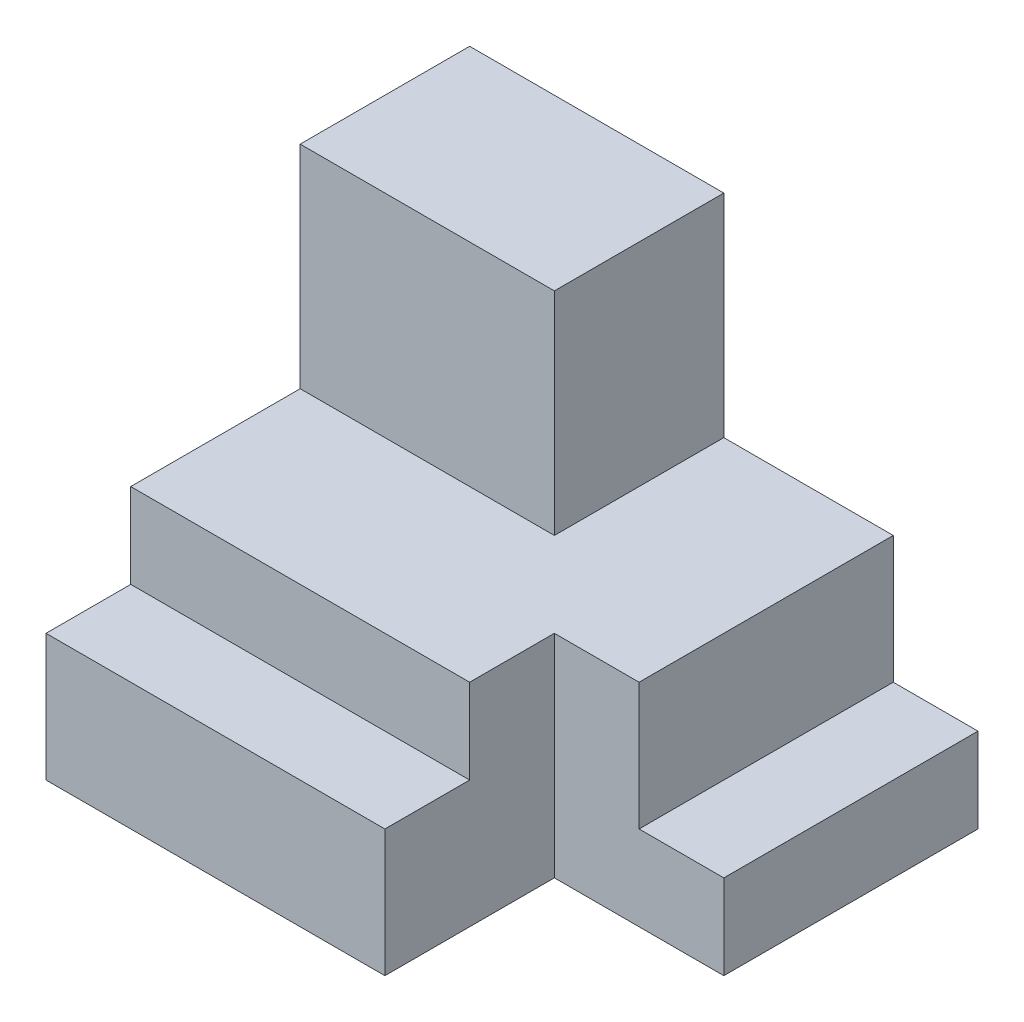
ISO-10303-21;
HEADER;
FILE_DESCRIPTION(('STEP AP214'),'2;1');
FILE_NAME('part.step','',(''),(''),'','','');
FILE_SCHEMA(('AUTOMOTIVE_DESIGN { 1 0 10303 214 1 1 1 1 }'));
ENDSEC;
DATA;
#1=APPLICATION_CONTEXT('core data for automotive mechanical design processes');
#2=APPLICATION_PROTOCOL_DEFINITION('international standard','automotive_design',2000,#1);
#3=PRODUCT_CONTEXT('',#1,'mechanical');
#4=PRODUCT('Part','Part','',(#3));
#5=PRODUCT_RELATED_PRODUCT_CATEGORY('part','',(#4));
#6=PRODUCT_DEFINITION_FORMATION('','',#4);
#7=PRODUCT_DEFINITION_CONTEXT('part definition',#1,'design');
#8=PRODUCT_DEFINITION('design','',#6,#7);
#9=PRODUCT_DEFINITION_SHAPE('','',#8);
#10=(LENGTH_UNIT() NAMED_UNIT(*) SI_UNIT(.MILLI.,.METRE.));
#11=(NAMED_UNIT(*) PLANE_ANGLE_UNIT() SI_UNIT($,.RADIAN.));
#12=(NAMED_UNIT(*) SI_UNIT($,.STERADIAN.) SOLID_ANGLE_UNIT());
#13=UNCERTAINTY_MEASURE_WITH_UNIT(LENGTH_MEASURE(1.E-05),#10,'distance_accuracy_value','');
#14=(GEOMETRIC_REPRESENTATION_CONTEXT(3) GLOBAL_UNCERTAINTY_ASSIGNED_CONTEXT((#13)) GLOBAL_UNIT_ASSIGNED_CONTEXT((#10,
#11,#12)) REPRESENTATION_CONTEXT('',''));
#15=CARTESIAN_POINT('',(0.,0.,0.));
#16=DIRECTION('',(0.,0.,1.));
#17=DIRECTION('',(1.,0.,0.));
#18=AXIS2_PLACEMENT_3D('',#15,#16,#17);
#19=CARTESIAN_POINT('',(0.,44.45,-12.7));
#20=DIRECTION('',(0.,0.,-1.));
#21=DIRECTION('',(-1.,0.,0.));
#22=AXIS2_PLACEMENT_3D('',#19,#20,#21);
#23=PLANE('',#22);
#24=DIRECTION('',(-1.,0.,0.));
#25=VECTOR('',#24,1.);
#26=CARTESIAN_POINT('',(0.,19.05,-12.7));
#27=LINE('',#26,#25);
#28=CARTESIAN_POINT('',(50.8,19.05,-12.7));
#29=VERTEX_POINT('',#28);
#30=CARTESIAN_POINT('',(0.,19.05,-12.7));
#31=VERTEX_POINT('',#30);
#32=EDGE_CURVE('E163',#29,#31,#27,.T.);
#33=ORIENTED_EDGE('',*,*,#32,.F.);
#34=DIRECTION('',(0.,-1.,0.));
#35=VECTOR('',#34,1.);
#36=CARTESIAN_POINT('',(50.8,44.45,-12.7));
#37=LINE('',#36,#35);
#38=CARTESIAN_POINT('',(50.8,31.75,-12.7));
#39=VERTEX_POINT('',#38);
#40=EDGE_CURVE('E196',#39,#29,#37,.T.);
#41=ORIENTED_EDGE('',*,*,#40,.F.);
#42=DIRECTION('',(-1.,0.,0.));
#43=VECTOR('',#42,1.);
#44=CARTESIAN_POINT('',(0.,31.75,-12.7));
#45=LINE('',#44,#43);
#46=CARTESIAN_POINT('',(0.,31.75,-12.7));
#47=VERTEX_POINT('',#46);
#48=EDGE_CURVE('E200',#39,#47,#45,.T.);
#49=ORIENTED_EDGE('',*,*,#48,.T.);
#50=DIRECTION('',(0.,-1.,0.));
#51=VECTOR('',#50,1.);
#52=CARTESIAN_POINT('',(0.,44.45,-12.7));
#53=LINE('',#52,#51);
#54=EDGE_CURVE('E195',#47,#31,#53,.T.);
#55=ORIENTED_EDGE('',*,*,#54,.T.);
#56=EDGE_LOOP('',(#33,#41,#49,#55));
#57=FACE_BOUND('',#56,.T.);
#58=ADVANCED_FACE('F41',(#57),#23,.F.);
#59=CARTESIAN_POINT('',(50.8,31.75,-25.4));
#60=DIRECTION('',(0.,0.,-1.));
#61=DIRECTION('',(-1.,0.,0.));
#62=AXIS2_PLACEMENT_3D('',#59,#60,#61);
#63=PLANE('',#62);
#64=DIRECTION('',(0.,1.,0.));
#65=VECTOR('',#64,1.);
#66=CARTESIAN_POINT('',(63.5,12.7,-25.4));
#67=LINE('',#66,#65);
#68=CARTESIAN_POINT('',(63.5,12.7,-25.4));
#69=VERTEX_POINT('',#68);
#70=CARTESIAN_POINT('',(63.5,31.75,-25.4));
#71=VERTEX_POINT('',#70);
#72=EDGE_CURVE('E223',#69,#71,#67,.T.);
#73=ORIENTED_EDGE('',*,*,#72,.T.);
#74=DIRECTION('',(1.,0.,0.));
#75=VECTOR('',#74,1.);
#76=CARTESIAN_POINT('',(50.8,31.75,-25.4));
#77=LINE('',#76,#75);
#78=CARTESIAN_POINT('',(50.8,31.75,-25.4));
#79=VERTEX_POINT('',#78);
#80=EDGE_CURVE('E236',#79,#71,#77,.T.);
#81=ORIENTED_EDGE('',*,*,#80,.F.);
#82=DIRECTION('',(0.,-1.,0.));
#83=VECTOR('',#82,1.);
#84=CARTESIAN_POINT('',(50.8,31.75,-25.4));
#85=LINE('',#84,#83);
#86=CARTESIAN_POINT('',(50.8,0.,-25.4));
#87=VERTEX_POINT('',#86);
#88=EDGE_CURVE('E11',#79,#87,#85,.T.);
#89=ORIENTED_EDGE('',*,*,#88,.T.);
#90=DIRECTION('',(1.,0.,0.));
#91=VECTOR('',#90,1.);
#92=CARTESIAN_POINT('',(50.8,0.,-25.4));
#93=LINE('',#92,#91);
#94=CARTESIAN_POINT('',(76.2,0.,-25.4));
#95=VERTEX_POINT('',#94);
#96=EDGE_CURVE('E248',#87,#95,#93,.T.);
#97=ORIENTED_EDGE('',*,*,#96,.T.);
#98=DIRECTION('',(0.,-1.,0.));
#99=VECTOR('',#98,1.);
#100=CARTESIAN_POINT('',(76.2,31.75,-25.4));
#101=LINE('',#100,#99);
#102=CARTESIAN_POINT('',(76.2,12.7,-25.4));
#103=VERTEX_POINT('',#102);
#104=EDGE_CURVE('E50',#103,#95,#101,.T.);
#105=ORIENTED_EDGE('',*,*,#104,.F.);
#106=DIRECTION('',(1.,0.,0.));
#107=VECTOR('',#106,1.);
#108=CARTESIAN_POINT('',(0.,12.7,-25.4));
#109=LINE('',#108,#107);
#110=EDGE_CURVE('E217',#69,#103,#109,.T.);
#111=ORIENTED_EDGE('',*,*,#110,.F.);
#112=EDGE_LOOP('',(#73,#81,#89,#97,#105,#111));
#113=FACE_BOUND('',#112,.T.);
#114=ADVANCED_FACE('F273',(#113),#63,.F.);
#115=CARTESIAN_POINT('',(76.2,31.75,-63.5));
#116=DIRECTION('',(0.,0.,1.));
#117=DIRECTION('',(1.,0.,0.));
#118=AXIS2_PLACEMENT_3D('',#115,#116,#117);
#119=PLANE('',#118);
#120=DIRECTION('',(0.,1.,0.));
#121=VECTOR('',#120,1.);
#122=CARTESIAN_POINT('',(63.5,12.7,-63.5));
#123=LINE('',#122,#121);
#124=CARTESIAN_POINT('',(63.5,12.7,-63.5));
#125=VERTEX_POINT('',#124);
#126=CARTESIAN_POINT('',(63.5,31.75,-63.5));
#127=VERTEX_POINT('',#126);
#128=EDGE_CURVE('E220',#125,#127,#123,.T.);
#129=ORIENTED_EDGE('',*,*,#128,.F.);
#130=DIRECTION('',(1.,0.,0.));
#131=VECTOR('',#130,1.);
#132=CARTESIAN_POINT('',(0.,12.7,-63.5));
#133=LINE('',#132,#131);
#134=CARTESIAN_POINT('',(76.2,12.7,-63.5));
#135=VERTEX_POINT('',#134);
#136=EDGE_CURVE('E210',#125,#135,#133,.T.);
#137=ORIENTED_EDGE('',*,*,#136,.T.);
#138=DIRECTION('',(0.,-1.,0.));
#139=VECTOR('',#138,1.);
#140=CARTESIAN_POINT('',(76.2,31.75,-63.5));
#141=LINE('',#140,#139);
#142=CARTESIAN_POINT('',(76.2,0.,-63.5));
#143=VERTEX_POINT('',#142);
#144=EDGE_CURVE('E260',#135,#143,#141,.T.);
#145=ORIENTED_EDGE('',*,*,#144,.T.);
#146=DIRECTION('',(-1.,0.,0.));
#147=VECTOR('',#146,1.);
#148=CARTESIAN_POINT('',(76.2,0.,-63.5));
#149=LINE('',#148,#147);
#150=CARTESIAN_POINT('',(0.,0.,-63.5));
#151=VERTEX_POINT('',#150);
#152=EDGE_CURVE('E233',#143,#151,#149,.T.);
#153=ORIENTED_EDGE('',*,*,#152,.T.);
#154=DIRECTION('',(0.,-1.,0.));
#155=VECTOR('',#154,1.);
#156=CARTESIAN_POINT('',(0.,31.75,-63.5));
#157=LINE('',#156,#155);
#158=CARTESIAN_POINT('',(0.,63.5,-63.5));
#159=VERTEX_POINT('',#158);
#160=EDGE_CURVE('E242',#159,#151,#157,.T.);
#161=ORIENTED_EDGE('',*,*,#160,.F.);
#162=DIRECTION('',(-1.,0.,0.));
#163=VECTOR('',#162,1.);
#164=CARTESIAN_POINT('',(38.1,63.5,-63.5));
#165=LINE('',#164,#163);
#166=CARTESIAN_POINT('',(38.1,63.5,-63.5));
#167=VERTEX_POINT('',#166);
#168=EDGE_CURVE('E154',#167,#159,#165,.T.);
#169=ORIENTED_EDGE('',*,*,#168,.F.);
#170=DIRECTION('',(0.,-1.,0.));
#171=VECTOR('',#170,1.);
#172=CARTESIAN_POINT('',(38.1,63.5,-63.5));
#173=LINE('',#172,#171);
#174=CARTESIAN_POINT('',(38.1,31.75,-63.5));
#175=VERTEX_POINT('',#174);
#176=EDGE_CURVE('E170',#167,#175,#173,.T.);
#177=ORIENTED_EDGE('',*,*,#176,.T.);
#178=DIRECTION('',(-1.,0.,0.));
#179=VECTOR('',#178,1.);
#180=CARTESIAN_POINT('',(76.2,31.75,-63.5));
#181=LINE('',#180,#179);
#182=EDGE_CURVE('E63',#127,#175,#181,.T.);
#183=ORIENTED_EDGE('',*,*,#182,.F.);
#184=EDGE_LOOP('',(#129,#137,#145,#153,#161,#169,#177,#183));
#185=FACE_BOUND('',#184,.T.);
#186=ADVANCED_FACE('F282',(#185),#119,.F.);
#187=CARTESIAN_POINT('',(0.,31.75,0.));
#188=DIRECTION('',(0.,1.,0.));
#189=DIRECTION('',(0.,0.,1.));
#190=AXIS2_PLACEMENT_3D('',#187,#188,#189);
#191=PLANE('',#190);
#192=DIRECTION('',(0.,0.,-1.));
#193=VECTOR('',#192,1.);
#194=CARTESIAN_POINT('',(38.1,31.75,-38.1));
#195=LINE('',#194,#193);
#196=CARTESIAN_POINT('',(38.1,31.75,-38.1));
#197=VERTEX_POINT('',#196);
#198=EDGE_CURVE('E158',#197,#175,#195,.T.);
#199=ORIENTED_EDGE('',*,*,#198,.F.);
#200=DIRECTION('',(1.,0.,0.));
#201=VECTOR('',#200,1.);
#202=CARTESIAN_POINT('',(0.,31.75,-38.1));
#203=LINE('',#202,#201);
#204=CARTESIAN_POINT('',(0.,31.75,-38.1));
#205=VERTEX_POINT('',#204);
#206=EDGE_CURVE('E57',#205,#197,#203,.T.);
#207=ORIENTED_EDGE('',*,*,#206,.F.);
#208=DIRECTION('',(0.,0.,1.));
#209=VECTOR('',#208,1.);
#210=CARTESIAN_POINT('',(0.,31.75,-63.5));
#211=LINE('',#210,#209);
#212=EDGE_CURVE('E161',#205,#47,#211,.T.);
#213=ORIENTED_EDGE('',*,*,#212,.T.);
#214=ORIENTED_EDGE('',*,*,#48,.F.);
#215=DIRECTION('',(0.,0.,-1.));
#216=VECTOR('',#215,1.);
#217=CARTESIAN_POINT('',(50.8,31.75,0.));
#218=LINE('',#217,#216);
#219=EDGE_CURVE('E232',#39,#79,#218,.T.);
#220=ORIENTED_EDGE('',*,*,#219,.T.);
#221=ORIENTED_EDGE('',*,*,#80,.T.);
#222=DIRECTION('',(0.,0.,-1.));
#223=VECTOR('',#222,1.);
#224=CARTESIAN_POINT('',(63.5,31.75,0.));
#225=LINE('',#224,#223);
#226=EDGE_CURVE('E206',#71,#127,#225,.T.);
#227=ORIENTED_EDGE('',*,*,#226,.T.);
#228=ORIENTED_EDGE('',*,*,#182,.T.);
#229=EDGE_LOOP('',(#199,#207,#213,#214,#220,#221,#227,#228));
#230=FACE_BOUND('',#229,.T.);
#231=ADVANCED_FACE('F295',(#230),#191,.T.);
#232=CARTESIAN_POINT('',(0.,31.75,-63.5));
#233=DIRECTION('',(1.,0.,0.));
#234=DIRECTION('',(0.,0.,-1.));
#235=AXIS2_PLACEMENT_3D('',#232,#233,#234);
#236=PLANE('',#235);
#237=DIRECTION('',(0.,0.,1.));
#238=VECTOR('',#237,1.);
#239=CARTESIAN_POINT('',(0.,0.,-63.5));
#240=LINE('',#239,#238);
#241=CARTESIAN_POINT('',(0.,0.,0.));
#242=VERTEX_POINT('',#241);
#243=EDGE_CURVE('E227',#151,#242,#240,.T.);
#244=ORIENTED_EDGE('',*,*,#243,.T.);
#245=DIRECTION('',(0.,-1.,0.));
#246=VECTOR('',#245,1.);
#247=CARTESIAN_POINT('',(0.,0.,0.));
#248=LINE('',#247,#246);
#249=CARTESIAN_POINT('',(0.,19.05,0.));
#250=VERTEX_POINT('',#249);
#251=EDGE_CURVE('E168',#250,#242,#248,.T.);
#252=ORIENTED_EDGE('',*,*,#251,.F.);
#253=DIRECTION('',(0.,0.,-1.));
#254=VECTOR('',#253,1.);
#255=CARTESIAN_POINT('',(0.,19.05,0.));
#256=LINE('',#255,#254);
#257=EDGE_CURVE('E186',#250,#31,#256,.T.);
#258=ORIENTED_EDGE('',*,*,#257,.T.);
#259=ORIENTED_EDGE('',*,*,#54,.F.);
#260=ORIENTED_EDGE('',*,*,#212,.F.);
#261=DIRECTION('',(0.,-1.,0.));
#262=VECTOR('',#261,1.);
#263=CARTESIAN_POINT('',(0.,63.5,-38.1));
#264=LINE('',#263,#262);
#265=CARTESIAN_POINT('',(0.,63.5,-38.1));
#266=VERTEX_POINT('',#265);
#267=EDGE_CURVE('E141',#266,#205,#264,.T.);
#268=ORIENTED_EDGE('',*,*,#267,.F.);
#269=DIRECTION('',(0.,0.,1.));
#270=VECTOR('',#269,1.);
#271=CARTESIAN_POINT('',(0.,63.5,-63.5));
#272=LINE('',#271,#270);
#273=EDGE_CURVE('E148',#159,#266,#272,.T.);
#274=ORIENTED_EDGE('',*,*,#273,.F.);
#275=ORIENTED_EDGE('',*,*,#160,.T.);
#276=EDGE_LOOP('',(#244,#252,#258,#259,#260,#268,#274,#275));
#277=FACE_BOUND('',#276,.T.);
#278=ADVANCED_FACE('F43',(#277),#236,.F.);
#279=CARTESIAN_POINT('',(50.8,31.75,0.));
#280=DIRECTION('',(-1.,0.,0.));
#281=DIRECTION('',(0.,0.,1.));
#282=AXIS2_PLACEMENT_3D('',#279,#280,#281);
#283=PLANE('',#282);
#284=ORIENTED_EDGE('',*,*,#219,.F.);
#285=ORIENTED_EDGE('',*,*,#40,.T.);
#286=DIRECTION('',(0.,0.,-1.));
#287=VECTOR('',#286,1.);
#288=CARTESIAN_POINT('',(50.8,19.05,0.));
#289=LINE('',#288,#287);
#290=CARTESIAN_POINT('',(50.8,19.05,0.));
#291=VERTEX_POINT('',#290);
#292=EDGE_CURVE('E191',#291,#29,#289,.T.);
#293=ORIENTED_EDGE('',*,*,#292,.F.);
#294=DIRECTION('',(0.,1.,0.));
#295=VECTOR('',#294,1.);
#296=CARTESIAN_POINT('',(50.8,0.,0.));
#297=LINE('',#296,#295);
#298=CARTESIAN_POINT('',(50.8,0.,0.));
#299=VERTEX_POINT('',#298);
#300=EDGE_CURVE('E181',#299,#291,#297,.T.);
#301=ORIENTED_EDGE('',*,*,#300,.F.);
#302=DIRECTION('',(0.,0.,-1.));
#303=VECTOR('',#302,1.);
#304=CARTESIAN_POINT('',(50.8,0.,0.));
#305=LINE('',#304,#303);
#306=EDGE_CURVE('E245',#299,#87,#305,.T.);
#307=ORIENTED_EDGE('',*,*,#306,.T.);
#308=ORIENTED_EDGE('',*,*,#88,.F.);
#309=EDGE_LOOP('',(#284,#285,#293,#301,#307,#308));
#310=FACE_BOUND('',#309,.T.);
#311=ADVANCED_FACE('F297',(#310),#283,.F.);
#312=CARTESIAN_POINT('',(76.2,31.75,-25.4));
#313=DIRECTION('',(-1.,0.,0.));
#314=DIRECTION('',(0.,0.,1.));
#315=AXIS2_PLACEMENT_3D('',#312,#313,#314);
#316=PLANE('',#315);
#317=ORIENTED_EDGE('',*,*,#144,.F.);
#318=DIRECTION('',(0.,0.,-1.));
#319=VECTOR('',#318,1.);
#320=CARTESIAN_POINT('',(76.2,12.7,0.));
#321=LINE('',#320,#319);
#322=EDGE_CURVE('E207',#103,#135,#321,.T.);
#323=ORIENTED_EDGE('',*,*,#322,.F.);
#324=ORIENTED_EDGE('',*,*,#104,.T.);
#325=DIRECTION('',(0.,0.,-1.));
#326=VECTOR('',#325,1.);
#327=CARTESIAN_POINT('',(76.2,0.,-25.4));
#328=LINE('',#327,#326);
#329=EDGE_CURVE('E252',#95,#143,#328,.T.);
#330=ORIENTED_EDGE('',*,*,#329,.T.);
#331=EDGE_LOOP('',(#317,#323,#324,#330));
#332=FACE_BOUND('',#331,.T.);
#333=ADVANCED_FACE('F267',(#332),#316,.F.);
#334=CARTESIAN_POINT('',(0.,0.,0.));
#335=DIRECTION('',(0.,1.,0.));
#336=DIRECTION('',(0.,0.,1.));
#337=AXIS2_PLACEMENT_3D('',#334,#335,#336);
#338=PLANE('',#337);
#339=ORIENTED_EDGE('',*,*,#306,.F.);
#340=DIRECTION('',(1.,0.,0.));
#341=VECTOR('',#340,1.);
#342=CARTESIAN_POINT('',(0.,0.,0.));
#343=LINE('',#342,#341);
#344=EDGE_CURVE('E177',#242,#299,#343,.T.);
#345=ORIENTED_EDGE('',*,*,#344,.F.);
#346=ORIENTED_EDGE('',*,*,#243,.F.);
#347=ORIENTED_EDGE('',*,*,#152,.F.);
#348=ORIENTED_EDGE('',*,*,#329,.F.);
#349=ORIENTED_EDGE('',*,*,#96,.F.);
#350=EDGE_LOOP('',(#339,#345,#346,#347,#348,#349));
#351=FACE_BOUND('',#350,.T.);
#352=ADVANCED_FACE('F277',(#351),#338,.F.);
#353=CARTESIAN_POINT('',(63.5,12.7,0.));
#354=DIRECTION('',(1.,0.,0.));
#355=DIRECTION('',(0.,0.,-1.));
#356=AXIS2_PLACEMENT_3D('',#353,#354,#355);
#357=PLANE('',#356);
#358=ORIENTED_EDGE('',*,*,#226,.F.);
#359=ORIENTED_EDGE('',*,*,#72,.F.);
#360=DIRECTION('',(0.,0.,-1.));
#361=VECTOR('',#360,1.);
#362=CARTESIAN_POINT('',(63.5,12.7,0.));
#363=LINE('',#362,#361);
#364=EDGE_CURVE('E214',#69,#125,#363,.T.);
#365=ORIENTED_EDGE('',*,*,#364,.T.);
#366=ORIENTED_EDGE('',*,*,#128,.T.);
#367=EDGE_LOOP('',(#358,#359,#365,#366));
#368=FACE_BOUND('',#367,.T.);
#369=ADVANCED_FACE('F332',(#368),#357,.T.);
#370=CARTESIAN_POINT('',(0.,12.7,0.));
#371=DIRECTION('',(0.,-1.,0.));
#372=DIRECTION('',(0.,0.,-1.));
#373=AXIS2_PLACEMENT_3D('',#370,#371,#372);
#374=PLANE('',#373);
#375=ORIENTED_EDGE('',*,*,#322,.T.);
#376=ORIENTED_EDGE('',*,*,#136,.F.);
#377=ORIENTED_EDGE('',*,*,#364,.F.);
#378=ORIENTED_EDGE('',*,*,#110,.T.);
#379=EDGE_LOOP('',(#375,#376,#377,#378));
#380=FACE_BOUND('',#379,.T.);
#381=ADVANCED_FACE('F329',(#380),#374,.F.);
#382=CARTESIAN_POINT('',(0.,19.05,0.));
#383=DIRECTION('',(0.,-1.,0.));
#384=DIRECTION('',(0.,0.,-1.));
#385=AXIS2_PLACEMENT_3D('',#382,#383,#384);
#386=PLANE('',#385);
#387=ORIENTED_EDGE('',*,*,#32,.T.);
#388=ORIENTED_EDGE('',*,*,#257,.F.);
#389=DIRECTION('',(-1.,0.,0.));
#390=VECTOR('',#389,1.);
#391=CARTESIAN_POINT('',(0.,19.05,0.));
#392=LINE('',#391,#390);
#393=EDGE_CURVE('E184',#291,#250,#392,.T.);
#394=ORIENTED_EDGE('',*,*,#393,.F.);
#395=ORIENTED_EDGE('',*,*,#292,.T.);
#396=EDGE_LOOP('',(#387,#388,#394,#395));
#397=FACE_BOUND('',#396,.T.);
#398=ADVANCED_FACE('F291',(#397),#386,.F.);
#399=CARTESIAN_POINT('',(0.,0.,0.));
#400=DIRECTION('',(0.,0.,-1.));
#401=DIRECTION('',(-1.,0.,0.));
#402=AXIS2_PLACEMENT_3D('',#399,#400,#401);
#403=PLANE('',#402);
#404=ORIENTED_EDGE('',*,*,#251,.T.);
#405=ORIENTED_EDGE('',*,*,#344,.T.);
#406=ORIENTED_EDGE('',*,*,#300,.T.);
#407=ORIENTED_EDGE('',*,*,#393,.T.);
#408=EDGE_LOOP('',(#404,#405,#406,#407));
#409=FACE_BOUND('',#408,.T.);
#410=ADVANCED_FACE('F286',(#409),#403,.F.);
#411=CARTESIAN_POINT('',(0.,63.5,-38.1));
#412=DIRECTION('',(0.,0.,-1.));
#413=DIRECTION('',(-1.,0.,0.));
#414=AXIS2_PLACEMENT_3D('',#411,#412,#413);
#415=PLANE('',#414);
#416=ORIENTED_EDGE('',*,*,#206,.T.);
#417=DIRECTION('',(0.,-1.,0.));
#418=VECTOR('',#417,1.);
#419=CARTESIAN_POINT('',(38.1,63.5,-38.1));
#420=LINE('',#419,#418);
#421=CARTESIAN_POINT('',(38.1,63.5,-38.1));
#422=VERTEX_POINT('',#421);
#423=EDGE_CURVE('E143',#422,#197,#420,.T.);
#424=ORIENTED_EDGE('',*,*,#423,.F.);
#425=DIRECTION('',(1.,0.,0.));
#426=VECTOR('',#425,1.);
#427=CARTESIAN_POINT('',(0.,63.5,-38.1));
#428=LINE('',#427,#426);
#429=EDGE_CURVE('E137',#266,#422,#428,.T.);
#430=ORIENTED_EDGE('',*,*,#429,.F.);
#431=ORIENTED_EDGE('',*,*,#267,.T.);
#432=EDGE_LOOP('',(#416,#424,#430,#431));
#433=FACE_BOUND('',#432,.T.);
#434=ADVANCED_FACE('F139',(#433),#415,.F.);
#435=CARTESIAN_POINT('',(38.1,63.5,-38.1));
#436=DIRECTION('',(-1.,0.,0.));
#437=DIRECTION('',(0.,0.,1.));
#438=AXIS2_PLACEMENT_3D('',#435,#436,#437);
#439=PLANE('',#438);
#440=ORIENTED_EDGE('',*,*,#198,.T.);
#441=ORIENTED_EDGE('',*,*,#176,.F.);
#442=DIRECTION('',(0.,0.,-1.));
#443=VECTOR('',#442,1.);
#444=CARTESIAN_POINT('',(38.1,63.5,-38.1));
#445=LINE('',#444,#443);
#446=EDGE_CURVE('E147',#422,#167,#445,.T.);
#447=ORIENTED_EDGE('',*,*,#446,.F.);
#448=ORIENTED_EDGE('',*,*,#423,.T.);
#449=EDGE_LOOP('',(#440,#441,#447,#448));
#450=FACE_BOUND('',#449,.T.);
#451=ADVANCED_FACE('F311',(#450),#439,.F.);
#452=CARTESIAN_POINT('',(0.,63.5,0.));
#453=DIRECTION('',(0.,1.,0.));
#454=DIRECTION('',(0.,0.,1.));
#455=AXIS2_PLACEMENT_3D('',#452,#453,#454);
#456=PLANE('',#455);
#457=ORIENTED_EDGE('',*,*,#273,.T.);
#458=ORIENTED_EDGE('',*,*,#429,.T.);
#459=ORIENTED_EDGE('',*,*,#446,.T.);
#460=ORIENTED_EDGE('',*,*,#168,.T.);
#461=EDGE_LOOP('',(#457,#458,#459,#460));
#462=FACE_BOUND('',#461,.T.);
#463=ADVANCED_FACE('F152',(#462),#456,.T.);
#464=CLOSED_SHELL('',(#58,#114,#186,#231,#278,#311,#333,#352,#369,#381,#398,#410,#434,#451,#463));
#465=MANIFOLD_SOLID_BREP('B2',#464);
#466=ADVANCED_BREP_SHAPE_REPRESENTATION('',(#18,#465),#14);
#467=SHAPE_DEFINITION_REPRESENTATION(#9,#466);
ENDSEC;
END-ISO-10303-21;
